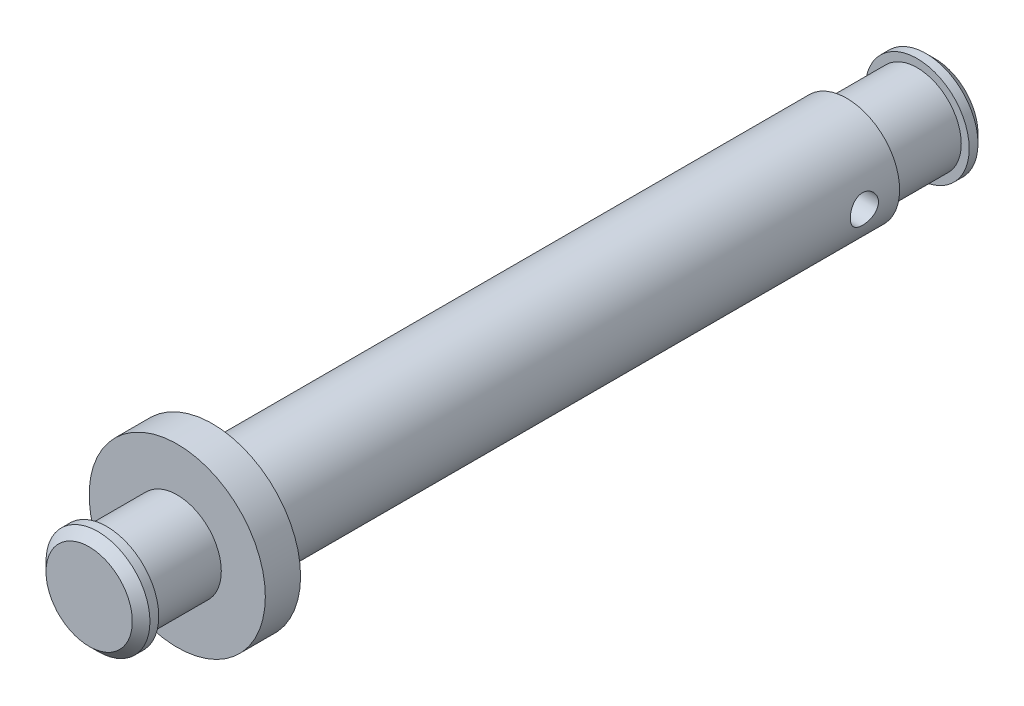
ISO-10303-21;
HEADER;
FILE_DESCRIPTION(('STEP AP214'),'2;1');
FILE_NAME('part.step','',(''),(''),'','','');
FILE_SCHEMA(('AUTOMOTIVE_DESIGN { 1 0 10303 214 1 1 1 1 }'));
ENDSEC;
DATA;
#1=APPLICATION_CONTEXT('core data for automotive mechanical design processes');
#2=APPLICATION_PROTOCOL_DEFINITION('international standard','automotive_design',2000,#1);
#3=PRODUCT_CONTEXT('',#1,'mechanical');
#4=PRODUCT('Part','Part','',(#3));
#5=PRODUCT_RELATED_PRODUCT_CATEGORY('part','',(#4));
#6=PRODUCT_DEFINITION_FORMATION('','',#4);
#7=PRODUCT_DEFINITION_CONTEXT('part definition',#1,'design');
#8=PRODUCT_DEFINITION('design','',#6,#7);
#9=PRODUCT_DEFINITION_SHAPE('','',#8);
#10=(LENGTH_UNIT() NAMED_UNIT(*) SI_UNIT(.MILLI.,.METRE.));
#11=(NAMED_UNIT(*) PLANE_ANGLE_UNIT() SI_UNIT($,.RADIAN.));
#12=(NAMED_UNIT(*) SI_UNIT($,.STERADIAN.) SOLID_ANGLE_UNIT());
#13=UNCERTAINTY_MEASURE_WITH_UNIT(LENGTH_MEASURE(1.E-05),#10,'distance_accuracy_value','');
#14=(GEOMETRIC_REPRESENTATION_CONTEXT(3) GLOBAL_UNCERTAINTY_ASSIGNED_CONTEXT((#13)) GLOBAL_UNIT_ASSIGNED_CONTEXT((#10,
#11,#12)) REPRESENTATION_CONTEXT('',''));
#15=CARTESIAN_POINT('',(0.,0.,0.));
#16=DIRECTION('',(0.,0.,1.));
#17=DIRECTION('',(1.,0.,0.));
#18=AXIS2_PLACEMENT_3D('',#15,#16,#17);
#19=CARTESIAN_POINT('',(0.,0.,5.));
#20=DIRECTION('',(0.,0.,-1.));
#21=DIRECTION('',(-1.,0.,0.));
#22=AXIS2_PLACEMENT_3D('',#19,#20,#21);
#23=PLANE('',#22);
#24=CARTESIAN_POINT('',(0.,0.,5.));
#25=DIRECTION('',(0.,0.,-1.));
#26=DIRECTION('',(-1.,0.,0.));
#27=AXIS2_PLACEMENT_3D('',#24,#25,#26);
#28=CIRCLE('',#27,2.45000000000001);
#29=CARTESIAN_POINT('',(-2.45000000000001,0.,5.));
#30=VERTEX_POINT('',#29);
#31=EDGE_CURVE('E40',#30,#30,#28,.F.);
#32=ORIENTED_EDGE('',*,*,#31,.T.);
#33=EDGE_LOOP('',(#32));
#34=FACE_BOUND('',#33,.T.);
#35=ADVANCED_FACE('F33',(#34),#23,.F.);
#36=CARTESIAN_POINT('',(0.,0.,0.));
#37=DIRECTION('',(0.,0.,1.));
#38=DIRECTION('',(1.,0.,0.));
#39=AXIS2_PLACEMENT_3D('',#36,#37,#38);
#40=CYLINDRICAL_SURFACE('',#39,2.95);
#41=CARTESIAN_POINT('',(0.,0.,4.5));
#42=DIRECTION('',(0.,0.,-1.));
#43=DIRECTION('',(-1.,0.,0.));
#44=AXIS2_PLACEMENT_3D('',#41,#42,#43);
#45=CIRCLE('',#44,2.95);
#46=CARTESIAN_POINT('',(-2.95,0.,4.5));
#47=VERTEX_POINT('',#46);
#48=EDGE_CURVE('E10',#47,#47,#45,.T.);
#49=ORIENTED_EDGE('',*,*,#48,.T.);
#50=EDGE_LOOP('',(#49));
#51=FACE_BOUND('',#50,.T.);
#52=CARTESIAN_POINT('',(0.,0.,4.));
#53=DIRECTION('',(0.,0.,1.));
#54=DIRECTION('',(1.,0.,0.));
#55=AXIS2_PLACEMENT_3D('',#52,#53,#54);
#56=CIRCLE('',#55,2.95);
#57=CARTESIAN_POINT('',(2.95,0.,4.));
#58=VERTEX_POINT('',#57);
#59=EDGE_CURVE('E53',#58,#58,#56,.T.);
#60=ORIENTED_EDGE('',*,*,#59,.T.);
#61=EDGE_LOOP('',(#60));
#62=FACE_BOUND('',#61,.T.);
#63=ADVANCED_FACE('F103',(#51,#62),#40,.T.);
#64=CARTESIAN_POINT('',(0.,2.95,4.));
#65=DIRECTION('',(0.,0.,1.));
#66=DIRECTION('',(1.,0.,0.));
#67=AXIS2_PLACEMENT_3D('',#64,#65,#66);
#68=PLANE('',#67);
#69=ORIENTED_EDGE('',*,*,#59,.F.);
#70=EDGE_LOOP('',(#69));
#71=FACE_BOUND('',#70,.T.);
#72=CARTESIAN_POINT('',(0.,0.,4.));
#73=DIRECTION('',(0.,0.,1.));
#74=DIRECTION('',(1.,0.,0.));
#75=AXIS2_PLACEMENT_3D('',#72,#73,#74);
#76=CIRCLE('',#75,2.5);
#77=CARTESIAN_POINT('',(2.5,0.,4.));
#78=VERTEX_POINT('',#77);
#79=EDGE_CURVE('E147',#78,#78,#76,.T.);
#80=ORIENTED_EDGE('',*,*,#79,.T.);
#81=EDGE_LOOP('',(#80));
#82=FACE_BOUND('',#81,.T.);
#83=ADVANCED_FACE('F108',(#71,#82),#68,.F.);
#84=CARTESIAN_POINT('',(0.,0.,0.));
#85=DIRECTION('',(0.,0.,1.));
#86=DIRECTION('',(1.,0.,0.));
#87=AXIS2_PLACEMENT_3D('',#84,#85,#86);
#88=CYLINDRICAL_SURFACE('',#87,2.5);
#89=ORIENTED_EDGE('',*,*,#79,.F.);
#90=EDGE_LOOP('',(#89));
#91=FACE_BOUND('',#90,.T.);
#92=CARTESIAN_POINT('',(0.,0.,0.));
#93=DIRECTION('',(0.,0.,1.));
#94=DIRECTION('',(1.,0.,0.));
#95=AXIS2_PLACEMENT_3D('',#92,#93,#94);
#96=CIRCLE('',#95,2.5);
#97=CARTESIAN_POINT('',(2.5,0.,0.));
#98=VERTEX_POINT('',#97);
#99=EDGE_CURVE('E144',#98,#98,#96,.T.);
#100=ORIENTED_EDGE('',*,*,#99,.T.);
#101=EDGE_LOOP('',(#100));
#102=FACE_BOUND('',#101,.T.);
#103=ADVANCED_FACE('F155',(#91,#102),#88,.T.);
#104=CARTESIAN_POINT('',(0.,2.5,0.));
#105=DIRECTION('',(0.,0.,-1.));
#106=DIRECTION('',(-1.,0.,0.));
#107=AXIS2_PLACEMENT_3D('',#104,#105,#106);
#108=PLANE('',#107);
#109=ORIENTED_EDGE('',*,*,#99,.F.);
#110=EDGE_LOOP('',(#109));
#111=FACE_BOUND('',#110,.T.);
#112=CARTESIAN_POINT('',(0.,0.,0.));
#113=DIRECTION('',(0.,0.,1.));
#114=DIRECTION('',(1.,0.,0.));
#115=AXIS2_PLACEMENT_3D('',#112,#113,#114);
#116=CIRCLE('',#115,5.);
#117=CARTESIAN_POINT('',(5.,0.,0.));
#118=VERTEX_POINT('',#117);
#119=EDGE_CURVE('E141',#118,#118,#116,.T.);
#120=ORIENTED_EDGE('',*,*,#119,.T.);
#121=EDGE_LOOP('',(#120));
#122=FACE_BOUND('',#121,.T.);
#123=ADVANCED_FACE('F160',(#111,#122),#108,.F.);
#124=CARTESIAN_POINT('',(0.,0.,0.));
#125=DIRECTION('',(0.,0.,1.));
#126=DIRECTION('',(1.,0.,0.));
#127=AXIS2_PLACEMENT_3D('',#124,#125,#126);
#128=CYLINDRICAL_SURFACE('',#127,5.);
#129=ORIENTED_EDGE('',*,*,#119,.F.);
#130=EDGE_LOOP('',(#129));
#131=FACE_BOUND('',#130,.T.);
#132=CARTESIAN_POINT('',(0.,0.,-2.));
#133=DIRECTION('',(0.,0.,1.));
#134=DIRECTION('',(1.,0.,0.));
#135=AXIS2_PLACEMENT_3D('',#132,#133,#134);
#136=CIRCLE('',#135,5.);
#137=CARTESIAN_POINT('',(5.,0.,-2.));
#138=VERTEX_POINT('',#137);
#139=EDGE_CURVE('E138',#138,#138,#136,.T.);
#140=ORIENTED_EDGE('',*,*,#139,.T.);
#141=EDGE_LOOP('',(#140));
#142=FACE_BOUND('',#141,.T.);
#143=ADVANCED_FACE('F166',(#131,#142),#128,.T.);
#144=CARTESIAN_POINT('',(0.,5.,-2.));
#145=DIRECTION('',(0.,0.,1.));
#146=DIRECTION('',(1.,0.,0.));
#147=AXIS2_PLACEMENT_3D('',#144,#145,#146);
#148=PLANE('',#147);
#149=ORIENTED_EDGE('',*,*,#139,.F.);
#150=EDGE_LOOP('',(#149));
#151=FACE_BOUND('',#150,.T.);
#152=CARTESIAN_POINT('',(0.,0.,-2.));
#153=DIRECTION('',(0.,0.,1.));
#154=DIRECTION('',(1.,0.,0.));
#155=AXIS2_PLACEMENT_3D('',#152,#153,#154);
#156=CIRCLE('',#155,3.);
#157=CARTESIAN_POINT('',(3.,0.,-2.));
#158=VERTEX_POINT('',#157);
#159=EDGE_CURVE('E135',#158,#158,#156,.T.);
#160=ORIENTED_EDGE('',*,*,#159,.T.);
#161=EDGE_LOOP('',(#160));
#162=FACE_BOUND('',#161,.T.);
#163=ADVANCED_FACE('F98',(#151,#162),#148,.F.);
#164=CARTESIAN_POINT('',(0.,0.,0.));
#165=DIRECTION('',(0.,0.,1.));
#166=DIRECTION('',(1.,0.,0.));
#167=AXIS2_PLACEMENT_3D('',#164,#165,#166);
#168=CYLINDRICAL_SURFACE('',#167,3.);
#169=CARTESIAN_POINT('',(3.,0.,-36.8));
#170=CARTESIAN_POINT('',(2.99999933524065,-0.044101822333142,-36.7999989532261));
#171=CARTESIAN_POINT('',(2.99901794464862,-0.0882148640887366,-36.7963409543241));
#172=CARTESIAN_POINT('',(2.99519829448662,-0.175170180541786,-36.7818315077045));
#173=CARTESIAN_POINT('',(2.9923591413303,-0.218011833327636,-36.7709765982296));
#174=CARTESIAN_POINT('',(2.98513733301121,-0.301156635618127,-36.7424513332544));
#175=CARTESIAN_POINT('',(2.98075666852169,-0.341462980406116,-36.7247897649336));
#176=CARTESIAN_POINT('',(2.97091479660652,-0.418541474557065,-36.6831851029334));
#177=CARTESIAN_POINT('',(2.96545351718002,-0.455313388179851,-36.6592415906563));
#178=CARTESIAN_POINT('',(2.95389845960869,-0.525131801496012,-36.6051665934346));
#179=CARTESIAN_POINT('',(2.9477938707174,-0.558084675945127,-36.5749165327966));
#180=CARTESIAN_POINT('',(2.93570963871569,-0.618514854642541,-36.5093406067747));
#181=CARTESIAN_POINT('',(2.92973001177898,-0.645991453982618,-36.4740140889533));
#182=CARTESIAN_POINT('',(2.91846214986764,-0.695145636973706,-36.3985407060695));
#183=CARTESIAN_POINT('',(2.91318755429117,-0.716715510946113,-36.3583214686941));
#184=CARTESIAN_POINT('',(2.90408590923454,-0.75275019230782,-36.2746639555642));
#185=CARTESIAN_POINT('',(2.9002585928704,-0.767216309804884,-36.2312262750719));
#186=CARTESIAN_POINT('',(2.89459646334927,-0.788307680905704,-36.1434017848693));
#187=CARTESIAN_POINT('',(2.89271859176123,-0.795102680979747,-36.0990585840191));
#188=CARTESIAN_POINT('',(2.89103932417876,-0.801188138824373,-36.0098249266668));
#189=CARTESIAN_POINT('',(2.89123754019361,-0.800479998822946,-35.9649345739858));
#190=CARTESIAN_POINT('',(2.89364951507618,-0.791714040010487,-35.8772058338511));
#191=CARTESIAN_POINT('',(2.89580694201076,-0.783861624258978,-35.8343451271848));
#192=CARTESIAN_POINT('',(2.90180405235812,-0.761358994888819,-35.7505726662173));
#193=CARTESIAN_POINT('',(2.90564387021998,-0.746708237972005,-35.7096610679698));
#194=CARTESIAN_POINT('',(2.91462264698391,-0.710857427861005,-35.6304127424766));
#195=CARTESIAN_POINT('',(2.91977577127223,-0.689585364551136,-35.5921102642855));
#196=CARTESIAN_POINT('',(2.93079291857236,-0.641146015295121,-35.5195463364594));
#197=CARTESIAN_POINT('',(2.93665708142145,-0.613977568897011,-35.4852856843374));
#198=CARTESIAN_POINT('',(2.94867004251873,-0.553466429053679,-35.4206044010181));
#199=CARTESIAN_POINT('',(2.95482188595513,-0.519951250913202,-35.390345472674));
#200=CARTESIAN_POINT('',(2.96654552510546,-0.448247067282554,-35.3358444878599));
#201=CARTESIAN_POINT('',(2.97211729795427,-0.410057877682037,-35.311602668519));
#202=CARTESIAN_POINT('',(2.98208728159312,-0.329839302198978,-35.2697528388701));
#203=CARTESIAN_POINT('',(2.98648029133423,-0.287793961020713,-35.2521740918206));
#204=CARTESIAN_POINT('',(2.99356017760401,-0.201200917756155,-35.2243811244746));
#205=CARTESIAN_POINT('',(2.996247426935,-0.156653764771325,-35.2141652949104));
#206=CARTESIAN_POINT('',(2.99955663423354,-0.0677016332582017,-35.2016420492329));
#207=CARTESIAN_POINT('',(3.00023598988385,-0.0233296950565481,-35.1991147840597));
#208=CARTESIAN_POINT('',(2.99961788676677,0.0652040183604825,-35.2014332656988));
#209=CARTESIAN_POINT('',(2.99832063232137,0.109365814824848,-35.2062782504423));
#210=CARTESIAN_POINT('',(2.99393214198412,0.195440979960716,-35.223023378984));
#211=CARTESIAN_POINT('',(2.99087210618547,0.237379940811119,-35.2348008984791));
#212=CARTESIAN_POINT('',(2.98330517957641,0.318682788470426,-35.2649343778032));
#213=CARTESIAN_POINT('',(2.9787981319841,0.358046395686403,-35.2832910505002));
#214=CARTESIAN_POINT('',(2.96870264223867,0.433935389867197,-35.3264695548723));
#215=CARTESIAN_POINT('',(2.96309474642193,0.470390075384523,-35.3514109867192));
#216=CARTESIAN_POINT('',(2.95144580946015,0.538673854158813,-35.4069006520631));
#217=CARTESIAN_POINT('',(2.94540468290222,0.570502031519499,-35.4374499930399));
#218=CARTESIAN_POINT('',(2.9333589834749,0.629555697915278,-35.5043142309984));
#219=CARTESIAN_POINT('',(2.92736024574781,0.656626076999947,-35.5407674245601));
#220=CARTESIAN_POINT('',(2.91626578870034,0.704268764739798,-35.6178258784379));
#221=CARTESIAN_POINT('',(2.91117003171109,0.724841344486111,-35.6584309654415));
#222=CARTESIAN_POINT('',(2.9025170736066,0.758749646345947,-35.7424381228353));
#223=CARTESIAN_POINT('',(2.89895099369493,0.772127249023593,-35.7858223247493));
#224=CARTESIAN_POINT('',(2.89375930092876,0.791364820483175,-35.8743357278935));
#225=CARTESIAN_POINT('',(2.89213319219128,0.797226710411955,-35.9194644801468));
#226=CARTESIAN_POINT('',(2.89104697818674,0.801155958613014,-36.008597915149));
#227=CARTESIAN_POINT('',(2.89151759094413,0.799472622471943,-36.0525909281021));
#228=CARTESIAN_POINT('',(2.89440958435317,0.788937504002252,-36.1396414056052));
#229=CARTESIAN_POINT('',(2.89683091480545,0.780085906140236,-36.1826988942006));
#230=CARTESIAN_POINT('',(2.90331028428499,0.75561006279867,-36.2663423008516));
#231=CARTESIAN_POINT('',(2.90735554007653,0.740038644302289,-36.3069447370928));
#232=CARTESIAN_POINT('',(2.91662727254676,0.702606218249583,-36.3849915322137));
#233=CARTESIAN_POINT('',(2.92185393448601,0.68074422409848,-36.4224353945202));
#234=CARTESIAN_POINT('',(2.93309168576127,0.63059563707526,-36.4942921437986));
#235=CARTESIAN_POINT('',(2.93912133240661,0.602138919071637,-36.5285834139905));
#236=CARTESIAN_POINT('',(2.95118201513218,0.539932214044403,-36.5919849806669));
#237=CARTESIAN_POINT('',(2.95721305119381,0.506180941743496,-36.6210940154675));
#238=CARTESIAN_POINT('',(2.96875124961583,0.433471992435469,-36.6739168950588));
#239=CARTESIAN_POINT('',(2.97424444525819,0.394418384700709,-36.6975020042597));
#240=CARTESIAN_POINT('',(2.9839352404116,0.312755456166755,-36.7377349663718));
#241=CARTESIAN_POINT('',(2.98813367073438,0.270148437878518,-36.7543872702654));
#242=CARTESIAN_POINT('',(2.99421901005387,0.189749881952396,-36.7781101141662));
#243=CARTESIAN_POINT('',(2.99637108237041,0.152304806626014,-36.786299753437));
#244=CARTESIAN_POINT('',(2.99926179614582,0.0765759181268306,-36.7972448824668));
#245=CARTESIAN_POINT('',(3.00000057718908,0.0382921881619442,-36.80000090888));
#246=CARTESIAN_POINT('',(3.,0.,-36.8));
#247=B_SPLINE_CURVE_WITH_KNOTS('',3,(#169,#170,#171,#172,#173,#174,#175,#176,#177,#178,#179,
#180,#181,#182,#183,#184,#185,#186,#187,#188,#189,#190,#191,#192,#193,#194,#195,#196,#197,#198,
#199,#200,#201,#202,#203,#204,#205,#206,#207,#208,#209,#210,#211,#212,#213,#214,#215,#216,#217,
#218,#219,#220,#221,#222,#223,#224,#225,#226,#227,#228,#229,#230,#231,#232,#233,#234,#235,#236,
#237,#238,#239,#240,#241,#242,#243,#244,#245,#246),.UNSPECIFIED.,.T.,.F.,(4,2,2,2,2,2,2,2,2,2,2,
2,2,2,2,2,2,2,2,2,2,2,2,2,2,2,2,2,2,2,2,2,2,2,2,2,2,2,4),(0.,0.132165039579828,
0.264393697504581,0.396452221188775,0.528519546834703,0.663339591819868,0.798176979700596,
0.935330330092925,1.07245837651881,1.20648863299036,1.34049384159395,1.47076400816065,
1.60104458722842,1.73279469336265,1.86457075244718,2.00064503922595,2.13672468772706,
2.27339523838884,2.41003590873723,2.54273087007486,2.67541211567807,2.80581414254513,
2.93623030307913,3.06920114399487,3.20219827301222,3.33894598550782,3.4756879920731,
3.61162519076597,3.74752763461532,3.87897336957384,4.01041572204176,4.1408430617526,
4.2712908684514,4.40557735824494,4.5398964972892,4.67708900908298,4.81419330454011,
4.92895927593274,5.04371391182492),.UNSPECIFIED.);
#248=CARTESIAN_POINT('',(3.,0.,-36.8));
#249=VERTEX_POINT('',#248);
#250=EDGE_CURVE('E54',#249,#249,#247,.T.);
#251=ORIENTED_EDGE('',*,*,#250,.T.);
#252=EDGE_LOOP('',(#251));
#253=FACE_BOUND('',#252,.T.);
#254=CARTESIAN_POINT('',(-3.,0.,-36.8));
#255=CARTESIAN_POINT('',(-2.99999933524065,0.044101822333142,-36.7999989532261));
#256=CARTESIAN_POINT('',(-2.99901794464862,0.0882148640887366,-36.7963409543241));
#257=CARTESIAN_POINT('',(-2.99519829448662,0.175170180541786,-36.7818315077045));
#258=CARTESIAN_POINT('',(-2.9923591413303,0.218011833327636,-36.7709765982296));
#259=CARTESIAN_POINT('',(-2.98513733301121,0.301156635618127,-36.7424513332544));
#260=CARTESIAN_POINT('',(-2.98075666852169,0.341462980406116,-36.7247897649336));
#261=CARTESIAN_POINT('',(-2.97091479660652,0.418541474557065,-36.6831851029334));
#262=CARTESIAN_POINT('',(-2.96545351718002,0.455313388179851,-36.6592415906563));
#263=CARTESIAN_POINT('',(-2.95389845960869,0.525131801496012,-36.6051665934346));
#264=CARTESIAN_POINT('',(-2.9477938707174,0.558084675945127,-36.5749165327966));
#265=CARTESIAN_POINT('',(-2.93570963871569,0.618514854642541,-36.5093406067747));
#266=CARTESIAN_POINT('',(-2.92973001177898,0.645991453982618,-36.4740140889533));
#267=CARTESIAN_POINT('',(-2.91846214986764,0.695145636973706,-36.3985407060695));
#268=CARTESIAN_POINT('',(-2.91318755429117,0.716715510946113,-36.3583214686941));
#269=CARTESIAN_POINT('',(-2.90408590923454,0.75275019230782,-36.2746639555642));
#270=CARTESIAN_POINT('',(-2.9002585928704,0.767216309804884,-36.2312262750719));
#271=CARTESIAN_POINT('',(-2.89459646334927,0.788307680905704,-36.1434017848693));
#272=CARTESIAN_POINT('',(-2.89271859176123,0.795102680979747,-36.0990585840191));
#273=CARTESIAN_POINT('',(-2.89103932417876,0.801188138824373,-36.0098249266668));
#274=CARTESIAN_POINT('',(-2.89123754019361,0.800479998822946,-35.9649345739858));
#275=CARTESIAN_POINT('',(-2.89364951507618,0.791714040010487,-35.8772058338511));
#276=CARTESIAN_POINT('',(-2.89580694201076,0.783861624258978,-35.8343451271848));
#277=CARTESIAN_POINT('',(-2.90180405235812,0.761358994888819,-35.7505726662173));
#278=CARTESIAN_POINT('',(-2.90564387021998,0.746708237972005,-35.7096610679698));
#279=CARTESIAN_POINT('',(-2.91462264698391,0.710857427861005,-35.6304127424766));
#280=CARTESIAN_POINT('',(-2.91977577127223,0.689585364551136,-35.5921102642855));
#281=CARTESIAN_POINT('',(-2.93079291857236,0.641146015295121,-35.5195463364594));
#282=CARTESIAN_POINT('',(-2.93665708142145,0.613977568897011,-35.4852856843374));
#283=CARTESIAN_POINT('',(-2.94867004251873,0.553466429053679,-35.4206044010181));
#284=CARTESIAN_POINT('',(-2.95482188595513,0.519951250913202,-35.390345472674));
#285=CARTESIAN_POINT('',(-2.96654552510546,0.448247067282554,-35.3358444878599));
#286=CARTESIAN_POINT('',(-2.97211729795427,0.410057877682037,-35.311602668519));
#287=CARTESIAN_POINT('',(-2.98208728159312,0.329839302198978,-35.2697528388701));
#288=CARTESIAN_POINT('',(-2.98648029133423,0.287793961020713,-35.2521740918206));
#289=CARTESIAN_POINT('',(-2.99356017760401,0.201200917756155,-35.2243811244746));
#290=CARTESIAN_POINT('',(-2.996247426935,0.156653764771325,-35.2141652949104));
#291=CARTESIAN_POINT('',(-2.99955663423354,0.0677016332582017,-35.2016420492329));
#292=CARTESIAN_POINT('',(-3.00023598988385,0.0233296950565481,-35.1991147840597));
#293=CARTESIAN_POINT('',(-2.99961788676677,-0.0652040183604825,-35.2014332656988));
#294=CARTESIAN_POINT('',(-2.99832063232137,-0.109365814824848,-35.2062782504423));
#295=CARTESIAN_POINT('',(-2.99393214198412,-0.195440979960716,-35.223023378984));
#296=CARTESIAN_POINT('',(-2.99087210618547,-0.237379940811119,-35.2348008984791));
#297=CARTESIAN_POINT('',(-2.98330517957641,-0.318682788470426,-35.2649343778032));
#298=CARTESIAN_POINT('',(-2.9787981319841,-0.358046395686403,-35.2832910505002));
#299=CARTESIAN_POINT('',(-2.96870264223867,-0.433935389867197,-35.3264695548723));
#300=CARTESIAN_POINT('',(-2.96309474642193,-0.470390075384523,-35.3514109867192));
#301=CARTESIAN_POINT('',(-2.95144580946015,-0.538673854158813,-35.4069006520631));
#302=CARTESIAN_POINT('',(-2.94540468290222,-0.570502031519499,-35.4374499930399));
#303=CARTESIAN_POINT('',(-2.9333589834749,-0.629555697915278,-35.5043142309984));
#304=CARTESIAN_POINT('',(-2.92736024574781,-0.656626076999947,-35.5407674245601));
#305=CARTESIAN_POINT('',(-2.91626578870034,-0.704268764739798,-35.6178258784379));
#306=CARTESIAN_POINT('',(-2.91117003171109,-0.724841344486111,-35.6584309654415));
#307=CARTESIAN_POINT('',(-2.9025170736066,-0.758749646345947,-35.7424381228353));
#308=CARTESIAN_POINT('',(-2.89895099369493,-0.772127249023593,-35.7858223247493));
#309=CARTESIAN_POINT('',(-2.89375930092876,-0.791364820483175,-35.8743357278935));
#310=CARTESIAN_POINT('',(-2.89213319219128,-0.797226710411955,-35.9194644801468));
#311=CARTESIAN_POINT('',(-2.89104697818674,-0.801155958613014,-36.008597915149));
#312=CARTESIAN_POINT('',(-2.89151759094413,-0.799472622471943,-36.0525909281021));
#313=CARTESIAN_POINT('',(-2.89440958435317,-0.788937504002252,-36.1396414056052));
#314=CARTESIAN_POINT('',(-2.89683091480545,-0.780085906140236,-36.1826988942006));
#315=CARTESIAN_POINT('',(-2.90331028428499,-0.75561006279867,-36.2663423008516));
#316=CARTESIAN_POINT('',(-2.90735554007653,-0.740038644302289,-36.3069447370928));
#317=CARTESIAN_POINT('',(-2.91662727254676,-0.702606218249583,-36.3849915322137));
#318=CARTESIAN_POINT('',(-2.92185393448601,-0.68074422409848,-36.4224353945202));
#319=CARTESIAN_POINT('',(-2.93309168576127,-0.63059563707526,-36.4942921437986));
#320=CARTESIAN_POINT('',(-2.93912133240661,-0.602138919071637,-36.5285834139905));
#321=CARTESIAN_POINT('',(-2.95118201513218,-0.539932214044403,-36.5919849806669));
#322=CARTESIAN_POINT('',(-2.95721305119381,-0.506180941743496,-36.6210940154675));
#323=CARTESIAN_POINT('',(-2.96875124961583,-0.433471992435469,-36.6739168950588));
#324=CARTESIAN_POINT('',(-2.97424444525819,-0.394418384700709,-36.6975020042597));
#325=CARTESIAN_POINT('',(-2.9839352404116,-0.312755456166755,-36.7377349663718));
#326=CARTESIAN_POINT('',(-2.98813367073438,-0.270148437878518,-36.7543872702654));
#327=CARTESIAN_POINT('',(-2.99421901005387,-0.189749881952396,-36.7781101141662));
#328=CARTESIAN_POINT('',(-2.99637108237041,-0.152304806626014,-36.786299753437));
#329=CARTESIAN_POINT('',(-2.99926179614582,-0.0765759181268306,-36.7972448824668));
#330=CARTESIAN_POINT('',(-3.00000057718908,-0.0382921881619442,-36.80000090888));
#331=CARTESIAN_POINT('',(-3.,0.,-36.8));
#332=B_SPLINE_CURVE_WITH_KNOTS('',3,(#254,#255,#256,#257,#258,#259,#260,#261,#262,#263,#264,
#265,#266,#267,#268,#269,#270,#271,#272,#273,#274,#275,#276,#277,#278,#279,#280,#281,#282,#283,
#284,#285,#286,#287,#288,#289,#290,#291,#292,#293,#294,#295,#296,#297,#298,#299,#300,#301,#302,
#303,#304,#305,#306,#307,#308,#309,#310,#311,#312,#313,#314,#315,#316,#317,#318,#319,#320,#321,
#322,#323,#324,#325,#326,#327,#328,#329,#330,#331),.UNSPECIFIED.,.T.,.F.,(4,2,2,2,2,2,2,2,2,2,2,
2,2,2,2,2,2,2,2,2,2,2,2,2,2,2,2,2,2,2,2,2,2,2,2,2,2,2,4),(0.,0.132165039579828,
0.264393697504581,0.396452221188775,0.528519546834703,0.663339591819868,0.798176979700596,
0.935330330092925,1.07245837651881,1.20648863299036,1.34049384159395,1.47076400816065,
1.60104458722842,1.73279469336265,1.86457075244718,2.00064503922595,2.13672468772706,
2.27339523838884,2.41003590873723,2.54273087007486,2.67541211567807,2.80581414254513,
2.93623030307913,3.06920114399487,3.20219827301222,3.33894598550782,3.4756879920731,
3.61162519076597,3.74752763461532,3.87897336957384,4.01041572204176,4.1408430617526,
4.2712908684514,4.40557735824494,4.5398964972892,4.67708900908298,4.81419330454011,
4.92895927593274,5.04371391182492),.UNSPECIFIED.);
#333=CARTESIAN_POINT('',(-3.,0.,-36.8));
#334=VERTEX_POINT('',#333);
#335=EDGE_CURVE('E62',#334,#334,#332,.T.);
#336=ORIENTED_EDGE('',*,*,#335,.T.);
#337=EDGE_LOOP('',(#336));
#338=FACE_BOUND('',#337,.T.);
#339=ORIENTED_EDGE('',*,*,#159,.F.);
#340=EDGE_LOOP('',(#339));
#341=FACE_BOUND('',#340,.T.);
#342=CARTESIAN_POINT('',(0.,0.,-38.));
#343=DIRECTION('',(0.,0.,1.));
#344=DIRECTION('',(1.,0.,0.));
#345=AXIS2_PLACEMENT_3D('',#342,#343,#344);
#346=CIRCLE('',#345,3.);
#347=CARTESIAN_POINT('',(3.,0.,-38.));
#348=VERTEX_POINT('',#347);
#349=EDGE_CURVE('E132',#348,#348,#346,.T.);
#350=ORIENTED_EDGE('',*,*,#349,.T.);
#351=EDGE_LOOP('',(#350));
#352=FACE_BOUND('',#351,.T.);
#353=ADVANCED_FACE('F66',(#253,#338,#341,#352),#168,.T.);
#354=CARTESIAN_POINT('',(0.,3.,-38.));
#355=DIRECTION('',(0.,0.,1.));
#356=DIRECTION('',(1.,0.,0.));
#357=AXIS2_PLACEMENT_3D('',#354,#355,#356);
#358=PLANE('',#357);
#359=ORIENTED_EDGE('',*,*,#349,.F.);
#360=EDGE_LOOP('',(#359));
#361=FACE_BOUND('',#360,.T.);
#362=CARTESIAN_POINT('',(0.,0.,-38.));
#363=DIRECTION('',(0.,0.,1.));
#364=DIRECTION('',(1.,0.,0.));
#365=AXIS2_PLACEMENT_3D('',#362,#363,#364);
#366=CIRCLE('',#365,2.5);
#367=CARTESIAN_POINT('',(2.5,0.,-38.));
#368=VERTEX_POINT('',#367);
#369=EDGE_CURVE('E127',#368,#368,#366,.T.);
#370=ORIENTED_EDGE('',*,*,#369,.T.);
#371=EDGE_LOOP('',(#370));
#372=FACE_BOUND('',#371,.T.);
#373=ADVANCED_FACE('F91',(#361,#372),#358,.F.);
#374=CARTESIAN_POINT('',(0.,0.,0.));
#375=DIRECTION('',(0.,0.,1.));
#376=DIRECTION('',(1.,0.,0.));
#377=AXIS2_PLACEMENT_3D('',#374,#375,#376);
#378=CYLINDRICAL_SURFACE('',#377,2.5);
#379=ORIENTED_EDGE('',*,*,#369,.F.);
#380=EDGE_LOOP('',(#379));
#381=FACE_BOUND('',#380,.T.);
#382=CARTESIAN_POINT('',(0.,0.,-42.));
#383=DIRECTION('',(0.,0.,1.));
#384=DIRECTION('',(1.,0.,0.));
#385=AXIS2_PLACEMENT_3D('',#382,#383,#384);
#386=CIRCLE('',#385,2.5);
#387=CARTESIAN_POINT('',(2.5,0.,-42.));
#388=VERTEX_POINT('',#387);
#389=EDGE_CURVE('E124',#388,#388,#386,.T.);
#390=ORIENTED_EDGE('',*,*,#389,.T.);
#391=EDGE_LOOP('',(#390));
#392=FACE_BOUND('',#391,.T.);
#393=ADVANCED_FACE('F88',(#381,#392),#378,.T.);
#394=CARTESIAN_POINT('',(0.,2.5,-42.));
#395=DIRECTION('',(0.,0.,-1.));
#396=DIRECTION('',(-1.,0.,0.));
#397=AXIS2_PLACEMENT_3D('',#394,#395,#396);
#398=PLANE('',#397);
#399=ORIENTED_EDGE('',*,*,#389,.F.);
#400=EDGE_LOOP('',(#399));
#401=FACE_BOUND('',#400,.T.);
#402=CARTESIAN_POINT('',(0.,0.,-42.));
#403=DIRECTION('',(0.,0.,1.));
#404=DIRECTION('',(1.,0.,0.));
#405=AXIS2_PLACEMENT_3D('',#402,#403,#404);
#406=CIRCLE('',#405,2.95);
#407=CARTESIAN_POINT('',(2.95,0.,-42.));
#408=VERTEX_POINT('',#407);
#409=EDGE_CURVE('E61',#408,#408,#406,.T.);
#410=ORIENTED_EDGE('',*,*,#409,.T.);
#411=EDGE_LOOP('',(#410));
#412=FACE_BOUND('',#411,.T.);
#413=ADVANCED_FACE('F84',(#401,#412),#398,.F.);
#414=CARTESIAN_POINT('',(0.,0.,0.));
#415=DIRECTION('',(0.,0.,1.));
#416=DIRECTION('',(1.,0.,0.));
#417=AXIS2_PLACEMENT_3D('',#414,#415,#416);
#418=CYLINDRICAL_SURFACE('',#417,2.95);
#419=CARTESIAN_POINT('',(0.,0.,-42.5));
#420=DIRECTION('',(0.,0.,1.));
#421=DIRECTION('',(1.,0.,0.));
#422=AXIS2_PLACEMENT_3D('',#419,#420,#421);
#423=CIRCLE('',#422,2.95);
#424=CARTESIAN_POINT('',(2.95,0.,-42.5));
#425=VERTEX_POINT('',#424);
#426=EDGE_CURVE('E48',#425,#425,#423,.T.);
#427=ORIENTED_EDGE('',*,*,#426,.T.);
#428=EDGE_LOOP('',(#427));
#429=FACE_BOUND('',#428,.T.);
#430=ORIENTED_EDGE('',*,*,#409,.F.);
#431=EDGE_LOOP('',(#430));
#432=FACE_BOUND('',#431,.T.);
#433=ADVANCED_FACE('F80',(#429,#432),#418,.T.);
#434=CARTESIAN_POINT('',(0.,2.95,-43.));
#435=DIRECTION('',(0.,0.,1.));
#436=DIRECTION('',(1.,0.,0.));
#437=AXIS2_PLACEMENT_3D('',#434,#435,#436);
#438=PLANE('',#437);
#439=CARTESIAN_POINT('',(0.,0.,-43.));
#440=DIRECTION('',(0.,0.,1.));
#441=DIRECTION('',(1.,0.,0.));
#442=AXIS2_PLACEMENT_3D('',#439,#440,#441);
#443=CIRCLE('',#442,2.44999999999999);
#444=CARTESIAN_POINT('',(2.44999999999999,0.,-43.));
#445=VERTEX_POINT('',#444);
#446=EDGE_CURVE('E44',#445,#445,#443,.F.);
#447=ORIENTED_EDGE('',*,*,#446,.T.);
#448=EDGE_LOOP('',(#447));
#449=FACE_BOUND('',#448,.T.);
#450=ADVANCED_FACE('F75',(#449),#438,.F.);
#451=CARTESIAN_POINT('',(-10.,0.,-36.));
#452=DIRECTION('',(1.,0.,0.));
#453=DIRECTION('',(0.,0.,-1.));
#454=AXIS2_PLACEMENT_3D('',#451,#452,#453);
#455=CYLINDRICAL_SURFACE('',#454,0.800000000000003);
#456=ORIENTED_EDGE('',*,*,#335,.F.);
#457=EDGE_LOOP('',(#456));
#458=FACE_BOUND('',#457,.T.);
#459=ORIENTED_EDGE('',*,*,#250,.F.);
#460=EDGE_LOOP('',(#459));
#461=FACE_BOUND('',#460,.T.);
#462=ADVANCED_FACE('F70',(#458,#461),#455,.F.);
#463=CARTESIAN_POINT('',(0.,0.,-42.5));
#464=DIRECTION('',(0.,0.,1.));
#465=DIRECTION('',(1.,0.,0.));
#466=AXIS2_PLACEMENT_3D('',#463,#464,#465);
#467=CONICAL_SURFACE('',#466,2.95,0.785398163397455);
#468=ORIENTED_EDGE('',*,*,#446,.F.);
#469=EDGE_LOOP('',(#468));
#470=FACE_BOUND('',#469,.T.);
#471=ORIENTED_EDGE('',*,*,#426,.F.);
#472=EDGE_LOOP('',(#471));
#473=FACE_BOUND('',#472,.T.);
#474=ADVANCED_FACE('F74',(#470,#473),#467,.T.);
#475=CARTESIAN_POINT('',(0.,0.,5.));
#476=DIRECTION('',(0.,0.,-1.));
#477=DIRECTION('',(-1.,0.,0.));
#478=AXIS2_PLACEMENT_3D('',#475,#476,#477);
#479=CONICAL_SURFACE('',#478,2.45000000000001,0.785398163397446);
#480=ORIENTED_EDGE('',*,*,#48,.F.);
#481=EDGE_LOOP('',(#480));
#482=FACE_BOUND('',#481,.T.);
#483=ORIENTED_EDGE('',*,*,#31,.F.);
#484=EDGE_LOOP('',(#483));
#485=FACE_BOUND('',#484,.T.);
#486=ADVANCED_FACE('F35',(#482,#485),#479,.T.);
#487=CLOSED_SHELL('',(#35,#63,#83,#103,#123,#143,#163,#353,#373,#393,#413,#433,#450,#462,#474,#486));
#488=MANIFOLD_SOLID_BREP('B2',#487);
#489=ADVANCED_BREP_SHAPE_REPRESENTATION('',(#18,#488),#14);
#490=SHAPE_DEFINITION_REPRESENTATION(#9,#489);
ENDSEC;
END-ISO-10303-21;
